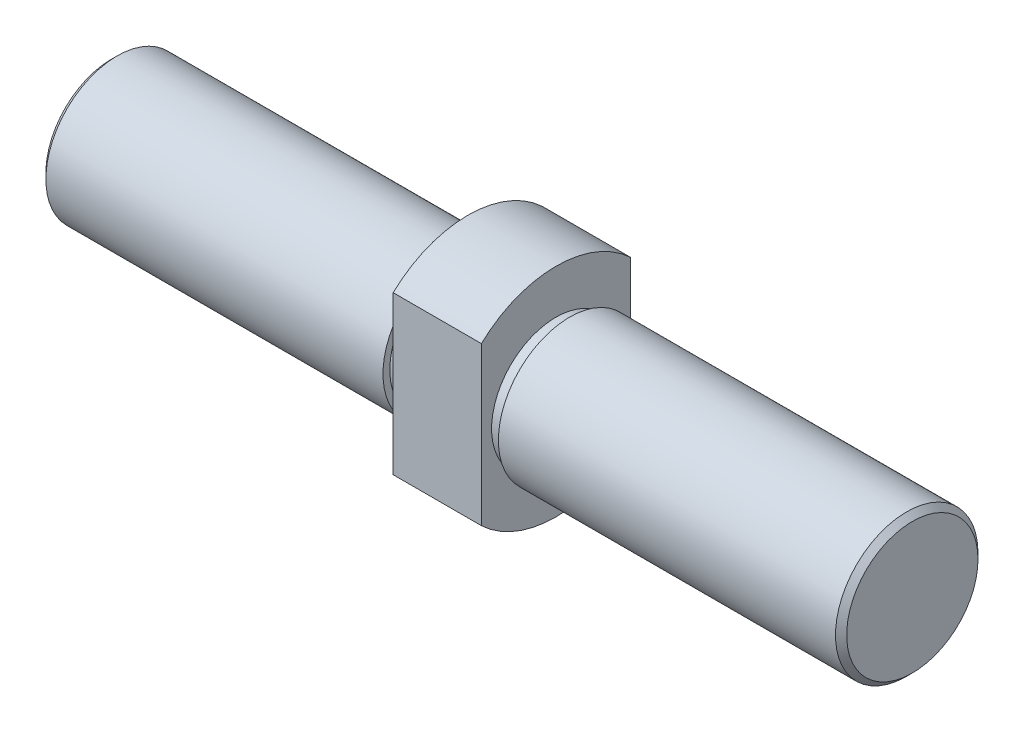
ISO-10303-21;
HEADER;
FILE_DESCRIPTION(('STEP AP214'),'2;1');
FILE_NAME('part.step','',(''),(''),'','','');
FILE_SCHEMA(('AUTOMOTIVE_DESIGN { 1 0 10303 214 1 1 1 1 }'));
ENDSEC;
DATA;
#1=APPLICATION_CONTEXT('core data for automotive mechanical design processes');
#2=APPLICATION_PROTOCOL_DEFINITION('international standard','automotive_design',2000,#1);
#3=PRODUCT_CONTEXT('',#1,'mechanical');
#4=PRODUCT('Part','Part','',(#3));
#5=PRODUCT_RELATED_PRODUCT_CATEGORY('part','',(#4));
#6=PRODUCT_DEFINITION_FORMATION('','',#4);
#7=PRODUCT_DEFINITION_CONTEXT('part definition',#1,'design');
#8=PRODUCT_DEFINITION('design','',#6,#7);
#9=PRODUCT_DEFINITION_SHAPE('','',#8);
#10=(LENGTH_UNIT() NAMED_UNIT(*) SI_UNIT(.MILLI.,.METRE.));
#11=(NAMED_UNIT(*) PLANE_ANGLE_UNIT() SI_UNIT($,.RADIAN.));
#12=(NAMED_UNIT(*) SI_UNIT($,.STERADIAN.) SOLID_ANGLE_UNIT());
#13=UNCERTAINTY_MEASURE_WITH_UNIT(LENGTH_MEASURE(1.E-05),#10,'distance_accuracy_value','');
#14=(GEOMETRIC_REPRESENTATION_CONTEXT(3) GLOBAL_UNCERTAINTY_ASSIGNED_CONTEXT((#13)) GLOBAL_UNIT_ASSIGNED_CONTEXT((#10,
#11,#12)) REPRESENTATION_CONTEXT('',''));
#15=CARTESIAN_POINT('',(0.,0.,0.));
#16=DIRECTION('',(0.,0.,1.));
#17=DIRECTION('',(1.,0.,0.));
#18=AXIS2_PLACEMENT_3D('',#15,#16,#17);
#19=CARTESIAN_POINT('',(118.,0.,0.));
#20=DIRECTION('',(-1.,0.,0.));
#21=DIRECTION('',(0.,0.,1.));
#22=AXIS2_PLACEMENT_3D('',#19,#20,#21);
#23=CYLINDRICAL_SURFACE('',#22,19.);
#24=CARTESIAN_POINT('',(13.,0.,0.));
#25=DIRECTION('',(1.,0.,0.));
#26=DIRECTION('',(0.,0.,-1.));
#27=AXIS2_PLACEMENT_3D('',#24,#25,#26);
#28=CIRCLE('',#27,19.);
#29=CARTESIAN_POINT('',(13.,0.,-19.));
#30=VERTEX_POINT('',#29);
#31=EDGE_CURVE('E128',#30,#30,#28,.T.);
#32=ORIENTED_EDGE('',*,*,#31,.T.);
#33=EDGE_LOOP('',(#32));
#34=FACE_BOUND('',#33,.T.);
#35=CARTESIAN_POINT('',(17.,0.,0.));
#36=DIRECTION('',(1.,0.,0.));
#37=DIRECTION('',(0.,0.,-1.));
#38=AXIS2_PLACEMENT_3D('',#35,#36,#37);
#39=CIRCLE('',#38,19.);
#40=CARTESIAN_POINT('',(17.,0.,-19.));
#41=VERTEX_POINT('',#40);
#42=EDGE_CURVE('E92',#41,#41,#39,.T.);
#43=ORIENTED_EDGE('',*,*,#42,.F.);
#44=EDGE_LOOP('',(#43));
#45=FACE_BOUND('',#44,.T.);
#46=ADVANCED_FACE('F41',(#34,#45),#23,.T.);
#47=CARTESIAN_POINT('',(13.,0.,0.));
#48=DIRECTION('',(1.,0.,0.));
#49=DIRECTION('',(0.,0.,-1.));
#50=AXIS2_PLACEMENT_3D('',#47,#48,#49);
#51=PLANE('',#50);
#52=DIRECTION('',(0.,-1.,0.));
#53=VECTOR('',#52,1.);
#54=CARTESIAN_POINT('',(13.,0.,-22.));
#55=LINE('',#54,#53);
#56=CARTESIAN_POINT('',(13.,23.2379000772445,-22.));
#57=VERTEX_POINT('',#56);
#58=CARTESIAN_POINT('',(13.,-23.2379000772445,-22.));
#59=VERTEX_POINT('',#58);
#60=EDGE_CURVE('E131',#57,#59,#55,.T.);
#61=ORIENTED_EDGE('',*,*,#60,.F.);
#62=CARTESIAN_POINT('',(13.,0.,0.));
#63=DIRECTION('',(1.,0.,0.));
#64=DIRECTION('',(0.,0.,-1.));
#65=AXIS2_PLACEMENT_3D('',#62,#63,#64);
#66=CIRCLE('',#65,32.);
#67=CARTESIAN_POINT('',(13.,23.2379000772445,22.));
#68=VERTEX_POINT('',#67);
#69=EDGE_CURVE('E88',#57,#68,#66,.T.);
#70=ORIENTED_EDGE('',*,*,#69,.T.);
#71=DIRECTION('',(0.,-1.,0.));
#72=VECTOR('',#71,1.);
#73=CARTESIAN_POINT('',(13.,0.,22.));
#74=LINE('',#73,#72);
#75=CARTESIAN_POINT('',(13.,-23.2379000772445,22.));
#76=VERTEX_POINT('',#75);
#77=EDGE_CURVE('E61',#68,#76,#74,.T.);
#78=ORIENTED_EDGE('',*,*,#77,.T.);
#79=EDGE_CURVE('E56',#76,#59,#66,.T.);
#80=ORIENTED_EDGE('',*,*,#79,.T.);
#81=EDGE_LOOP('',(#61,#70,#78,#80));
#82=FACE_BOUND('',#81,.T.);
#83=ORIENTED_EDGE('',*,*,#31,.F.);
#84=EDGE_LOOP('',(#83));
#85=FACE_BOUND('',#84,.T.);
#86=ADVANCED_FACE('F158',(#82,#85),#51,.T.);
#87=CARTESIAN_POINT('',(13.,0.,-22.));
#88=DIRECTION('',(0.,0.,-1.));
#89=DIRECTION('',(-1.,0.,0.));
#90=AXIS2_PLACEMENT_3D('',#87,#88,#89);
#91=PLANE('',#90);
#92=DIRECTION('',(-1.,0.,0.));
#93=VECTOR('',#92,1.);
#94=CARTESIAN_POINT('',(13.,-23.2379000772445,-22.));
#95=LINE('',#94,#93);
#96=CARTESIAN_POINT('',(-13.,-23.2379000772445,-22.));
#97=VERTEX_POINT('',#96);
#98=EDGE_CURVE('E106',#59,#97,#95,.T.);
#99=ORIENTED_EDGE('',*,*,#98,.T.);
#100=DIRECTION('',(0.,-1.,0.));
#101=VECTOR('',#100,1.);
#102=CARTESIAN_POINT('',(-13.,0.,-22.));
#103=LINE('',#102,#101);
#104=CARTESIAN_POINT('',(-13.,23.2379000772445,-22.));
#105=VERTEX_POINT('',#104);
#106=EDGE_CURVE('E100',#105,#97,#103,.T.);
#107=ORIENTED_EDGE('',*,*,#106,.F.);
#108=DIRECTION('',(-1.,0.,0.));
#109=VECTOR('',#108,1.);
#110=CARTESIAN_POINT('',(13.,23.2379000772445,-22.));
#111=LINE('',#110,#109);
#112=EDGE_CURVE('E82',#57,#105,#111,.T.);
#113=ORIENTED_EDGE('',*,*,#112,.F.);
#114=ORIENTED_EDGE('',*,*,#60,.T.);
#115=EDGE_LOOP('',(#99,#107,#113,#114));
#116=FACE_BOUND('',#115,.T.);
#117=ADVANCED_FACE('F105',(#116),#91,.T.);
#118=CARTESIAN_POINT('',(13.,0.,0.));
#119=DIRECTION('',(-1.,0.,0.));
#120=DIRECTION('',(0.,0.,1.));
#121=AXIS2_PLACEMENT_3D('',#118,#119,#120);
#122=CYLINDRICAL_SURFACE('',#121,32.);
#123=ORIENTED_EDGE('',*,*,#112,.T.);
#124=CARTESIAN_POINT('',(-13.,0.,0.));
#125=DIRECTION('',(1.,0.,0.));
#126=DIRECTION('',(0.,0.,-1.));
#127=AXIS2_PLACEMENT_3D('',#124,#125,#126);
#128=CIRCLE('',#127,32.);
#129=CARTESIAN_POINT('',(-13.,23.2379000772445,22.));
#130=VERTEX_POINT('',#129);
#131=EDGE_CURVE('E86',#105,#130,#128,.T.);
#132=ORIENTED_EDGE('',*,*,#131,.T.);
#133=DIRECTION('',(-1.,0.,0.));
#134=VECTOR('',#133,1.);
#135=CARTESIAN_POINT('',(13.,23.2379000772445,22.));
#136=LINE('',#135,#134);
#137=EDGE_CURVE('E93',#68,#130,#136,.T.);
#138=ORIENTED_EDGE('',*,*,#137,.F.);
#139=ORIENTED_EDGE('',*,*,#69,.F.);
#140=EDGE_LOOP('',(#123,#132,#138,#139));
#141=FACE_BOUND('',#140,.T.);
#142=ADVANCED_FACE('F84',(#141),#122,.T.);
#143=CARTESIAN_POINT('',(13.,0.,22.));
#144=DIRECTION('',(0.,0.,-1.));
#145=DIRECTION('',(-1.,0.,0.));
#146=AXIS2_PLACEMENT_3D('',#143,#144,#145);
#147=PLANE('',#146);
#148=ORIENTED_EDGE('',*,*,#137,.T.);
#149=DIRECTION('',(0.,-1.,0.));
#150=VECTOR('',#149,1.);
#151=CARTESIAN_POINT('',(-13.,0.,22.));
#152=LINE('',#151,#150);
#153=CARTESIAN_POINT('',(-13.,-23.2379000772445,22.));
#154=VERTEX_POINT('',#153);
#155=EDGE_CURVE('E102',#130,#154,#152,.T.);
#156=ORIENTED_EDGE('',*,*,#155,.T.);
#157=DIRECTION('',(-1.,0.,0.));
#158=VECTOR('',#157,1.);
#159=CARTESIAN_POINT('',(13.,-23.2379000772445,22.));
#160=LINE('',#159,#158);
#161=EDGE_CURVE('E136',#76,#154,#160,.T.);
#162=ORIENTED_EDGE('',*,*,#161,.F.);
#163=ORIENTED_EDGE('',*,*,#77,.F.);
#164=EDGE_LOOP('',(#148,#156,#162,#163));
#165=FACE_BOUND('',#164,.T.);
#166=ADVANCED_FACE('F172',(#165),#147,.F.);
#167=ORIENTED_EDGE('',*,*,#161,.T.);
#168=EDGE_CURVE('E104',#154,#97,#128,.T.);
#169=ORIENTED_EDGE('',*,*,#168,.T.);
#170=ORIENTED_EDGE('',*,*,#98,.F.);
#171=ORIENTED_EDGE('',*,*,#79,.F.);
#172=EDGE_LOOP('',(#167,#169,#170,#171));
#173=FACE_BOUND('',#172,.T.);
#174=ADVANCED_FACE('F168',(#173),#122,.T.);
#175=CARTESIAN_POINT('',(17.,0.,0.));
#176=DIRECTION('',(1.,0.,0.));
#177=DIRECTION('',(0.,0.,-1.));
#178=AXIS2_PLACEMENT_3D('',#175,#176,#177);
#179=PLANE('',#178);
#180=CARTESIAN_POINT('',(17.,0.,0.));
#181=DIRECTION('',(1.,0.,0.));
#182=DIRECTION('',(0.,0.,-1.));
#183=AXIS2_PLACEMENT_3D('',#180,#181,#182);
#184=CIRCLE('',#183,21.);
#185=CARTESIAN_POINT('',(17.,0.,-21.));
#186=VERTEX_POINT('',#185);
#187=EDGE_CURVE('E125',#186,#186,#184,.F.);
#188=ORIENTED_EDGE('',*,*,#187,.T.);
#189=EDGE_LOOP('',(#188));
#190=FACE_BOUND('',#189,.T.);
#191=ORIENTED_EDGE('',*,*,#42,.T.);
#192=EDGE_LOOP('',(#191));
#193=FACE_BOUND('',#192,.T.);
#194=ADVANCED_FACE('F171',(#190,#193),#179,.F.);
#195=CARTESIAN_POINT('',(-46.39696961967,0.,0.));
#196=DIRECTION('',(1.,0.,0.));
#197=DIRECTION('',(0.,0.,-1.));
#198=AXIS2_PLACEMENT_3D('',#195,#196,#197);
#199=CYLINDRICAL_SURFACE('',#198,21.);
#200=CARTESIAN_POINT('',(116.352,0.,0.));
#201=DIRECTION('',(1.,0.,0.));
#202=DIRECTION('',(0.,0.,-1.));
#203=AXIS2_PLACEMENT_3D('',#200,#201,#202);
#204=CIRCLE('',#203,21.);
#205=CARTESIAN_POINT('',(116.352,0.,-21.));
#206=VERTEX_POINT('',#205);
#207=EDGE_CURVE('E13',#206,#206,#204,.F.);
#208=ORIENTED_EDGE('',*,*,#207,.T.);
#209=EDGE_LOOP('',(#208));
#210=FACE_BOUND('',#209,.T.);
#211=ORIENTED_EDGE('',*,*,#187,.F.);
#212=EDGE_LOOP('',(#211));
#213=FACE_BOUND('',#212,.T.);
#214=ADVANCED_FACE('F154',(#210,#213),#199,.T.);
#215=CARTESIAN_POINT('',(118.,0.,0.));
#216=DIRECTION('',(1.,0.,0.));
#217=DIRECTION('',(0.,0.,-1.));
#218=AXIS2_PLACEMENT_3D('',#215,#216,#217);
#219=PLANE('',#218);
#220=CARTESIAN_POINT('',(118.,0.,0.));
#221=DIRECTION('',(1.,0.,0.));
#222=DIRECTION('',(0.,0.,-1.));
#223=AXIS2_PLACEMENT_3D('',#220,#221,#222);
#224=CIRCLE('',#223,19.352);
#225=CARTESIAN_POINT('',(118.,0.,-19.352));
#226=VERTEX_POINT('',#225);
#227=EDGE_CURVE('E49',#226,#226,#224,.T.);
#228=ORIENTED_EDGE('',*,*,#227,.T.);
#229=EDGE_LOOP('',(#228));
#230=FACE_BOUND('',#229,.T.);
#231=ADVANCED_FACE('F143',(#230),#219,.T.);
#232=CARTESIAN_POINT('',(118.,0.,0.));
#233=DIRECTION('',(-1.,0.,0.));
#234=DIRECTION('',(0.,0.,1.));
#235=AXIS2_PLACEMENT_3D('',#232,#233,#234);
#236=CONICAL_SURFACE('',#235,19.352,0.785398163397451);
#237=ORIENTED_EDGE('',*,*,#207,.F.);
#238=EDGE_LOOP('',(#237));
#239=FACE_BOUND('',#238,.T.);
#240=ORIENTED_EDGE('',*,*,#227,.F.);
#241=EDGE_LOOP('',(#240));
#242=FACE_BOUND('',#241,.T.);
#243=ADVANCED_FACE('F43',(#239,#242),#236,.T.);
#244=CARTESIAN_POINT('',(-118.,0.,0.));
#245=DIRECTION('',(1.,0.,0.));
#246=DIRECTION('',(0.,0.,1.));
#247=AXIS2_PLACEMENT_3D('',#244,#245,#246);
#248=CYLINDRICAL_SURFACE('',#247,19.);
#249=CARTESIAN_POINT('',(-13.,0.,0.));
#250=DIRECTION('',(1.,0.,0.));
#251=DIRECTION('',(0.,0.,-1.));
#252=AXIS2_PLACEMENT_3D('',#249,#250,#251);
#253=CIRCLE('',#252,19.);
#254=CARTESIAN_POINT('',(-13.,0.,-19.));
#255=VERTEX_POINT('',#254);
#256=EDGE_CURVE('E108',#255,#255,#253,.T.);
#257=ORIENTED_EDGE('',*,*,#256,.F.);
#258=EDGE_LOOP('',(#257));
#259=FACE_BOUND('',#258,.T.);
#260=CARTESIAN_POINT('',(-17.,0.,0.));
#261=DIRECTION('',(1.,0.,0.));
#262=DIRECTION('',(0.,0.,-1.));
#263=AXIS2_PLACEMENT_3D('',#260,#261,#262);
#264=CIRCLE('',#263,19.);
#265=CARTESIAN_POINT('',(-17.,0.,-19.));
#266=VERTEX_POINT('',#265);
#267=EDGE_CURVE('E116',#266,#266,#264,.T.);
#268=ORIENTED_EDGE('',*,*,#267,.T.);
#269=EDGE_LOOP('',(#268));
#270=FACE_BOUND('',#269,.T.);
#271=ADVANCED_FACE('F146',(#259,#270),#248,.T.);
#272=CARTESIAN_POINT('',(-13.,0.,0.));
#273=DIRECTION('',(-1.,0.,0.));
#274=DIRECTION('',(0.,0.,-1.));
#275=AXIS2_PLACEMENT_3D('',#272,#273,#274);
#276=PLANE('',#275);
#277=ORIENTED_EDGE('',*,*,#106,.T.);
#278=ORIENTED_EDGE('',*,*,#168,.F.);
#279=ORIENTED_EDGE('',*,*,#155,.F.);
#280=ORIENTED_EDGE('',*,*,#131,.F.);
#281=EDGE_LOOP('',(#277,#278,#279,#280));
#282=FACE_BOUND('',#281,.T.);
#283=ORIENTED_EDGE('',*,*,#256,.T.);
#284=EDGE_LOOP('',(#283));
#285=FACE_BOUND('',#284,.T.);
#286=ADVANCED_FACE('F97',(#282,#285),#276,.T.);
#287=CARTESIAN_POINT('',(-17.,0.,0.));
#288=DIRECTION('',(-1.,0.,0.));
#289=DIRECTION('',(0.,0.,-1.));
#290=AXIS2_PLACEMENT_3D('',#287,#288,#289);
#291=PLANE('',#290);
#292=CARTESIAN_POINT('',(-17.,0.,0.));
#293=DIRECTION('',(1.,0.,0.));
#294=DIRECTION('',(0.,0.,-1.));
#295=AXIS2_PLACEMENT_3D('',#292,#293,#294);
#296=CIRCLE('',#295,21.);
#297=CARTESIAN_POINT('',(-17.,0.,-21.));
#298=VERTEX_POINT('',#297);
#299=EDGE_CURVE('E111',#298,#298,#296,.F.);
#300=ORIENTED_EDGE('',*,*,#299,.F.);
#301=EDGE_LOOP('',(#300));
#302=FACE_BOUND('',#301,.T.);
#303=ORIENTED_EDGE('',*,*,#267,.F.);
#304=EDGE_LOOP('',(#303));
#305=FACE_BOUND('',#304,.T.);
#306=ADVANCED_FACE('F243',(#302,#305),#291,.F.);
#307=CARTESIAN_POINT('',(46.39696961967,0.,0.));
#308=DIRECTION('',(-1.,0.,0.));
#309=DIRECTION('',(0.,0.,-1.));
#310=AXIS2_PLACEMENT_3D('',#307,#308,#309);
#311=CYLINDRICAL_SURFACE('',#310,21.);
#312=CARTESIAN_POINT('',(-116.352,0.,0.));
#313=DIRECTION('',(1.,0.,0.));
#314=DIRECTION('',(0.,0.,-1.));
#315=AXIS2_PLACEMENT_3D('',#312,#313,#314);
#316=CIRCLE('',#315,21.);
#317=CARTESIAN_POINT('',(-116.352,0.,-21.));
#318=VERTEX_POINT('',#317);
#319=EDGE_CURVE('E122',#318,#318,#316,.F.);
#320=ORIENTED_EDGE('',*,*,#319,.F.);
#321=EDGE_LOOP('',(#320));
#322=FACE_BOUND('',#321,.T.);
#323=ORIENTED_EDGE('',*,*,#299,.T.);
#324=EDGE_LOOP('',(#323));
#325=FACE_BOUND('',#324,.T.);
#326=ADVANCED_FACE('F238',(#322,#325),#311,.T.);
#327=CARTESIAN_POINT('',(-118.,0.,0.));
#328=DIRECTION('',(-1.,0.,0.));
#329=DIRECTION('',(0.,0.,-1.));
#330=AXIS2_PLACEMENT_3D('',#327,#328,#329);
#331=PLANE('',#330);
#332=CARTESIAN_POINT('',(-118.,0.,0.));
#333=DIRECTION('',(1.,0.,0.));
#334=DIRECTION('',(0.,0.,-1.));
#335=AXIS2_PLACEMENT_3D('',#332,#333,#334);
#336=CIRCLE('',#335,19.352);
#337=CARTESIAN_POINT('',(-118.,0.,-19.352));
#338=VERTEX_POINT('',#337);
#339=EDGE_CURVE('E119',#338,#338,#336,.T.);
#340=ORIENTED_EDGE('',*,*,#339,.F.);
#341=EDGE_LOOP('',(#340));
#342=FACE_BOUND('',#341,.T.);
#343=ADVANCED_FACE('F242',(#342),#331,.T.);
#344=CARTESIAN_POINT('',(-118.,0.,0.));
#345=DIRECTION('',(1.,0.,0.));
#346=DIRECTION('',(0.,0.,1.));
#347=AXIS2_PLACEMENT_3D('',#344,#345,#346);
#348=CONICAL_SURFACE('',#347,19.352,0.785398163397451);
#349=ORIENTED_EDGE('',*,*,#319,.T.);
#350=EDGE_LOOP('',(#349));
#351=FACE_BOUND('',#350,.T.);
#352=ORIENTED_EDGE('',*,*,#339,.T.);
#353=EDGE_LOOP('',(#352));
#354=FACE_BOUND('',#353,.T.);
#355=ADVANCED_FACE('F258',(#351,#354),#348,.T.);
#356=CLOSED_SHELL('',(#46,#86,#117,#142,#166,#174,#194,#214,#231,#243,#271,#286,#306,#326,#343,#355));
#357=MANIFOLD_SOLID_BREP('B2',#356);
#358=ADVANCED_BREP_SHAPE_REPRESENTATION('',(#18,#357),#14);
#359=SHAPE_DEFINITION_REPRESENTATION(#9,#358);
ENDSEC;
END-ISO-10303-21;
